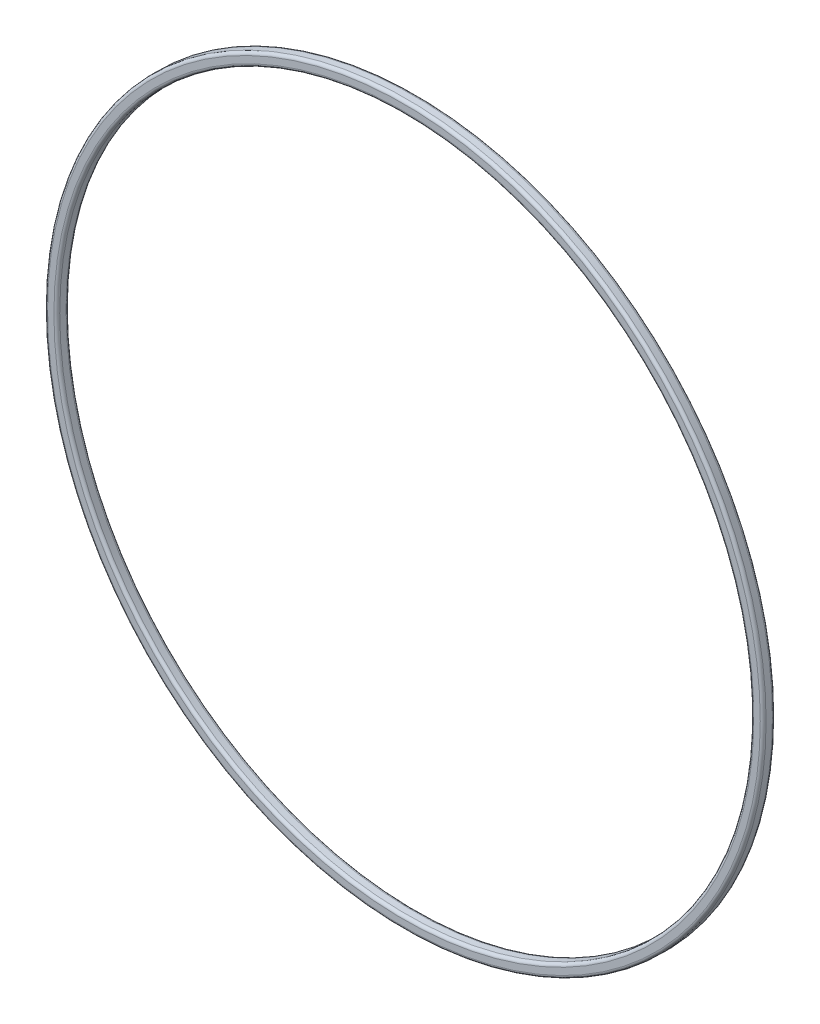
ISO-10303-21;
HEADER;
FILE_DESCRIPTION(('STEP AP214'),'2;1');
FILE_NAME('part.step','',(''),(''),'','','');
FILE_SCHEMA(('AUTOMOTIVE_DESIGN { 1 0 10303 214 1 1 1 1 }'));
ENDSEC;
DATA;
#1=APPLICATION_CONTEXT('core data for automotive mechanical design processes');
#2=APPLICATION_PROTOCOL_DEFINITION('international standard','automotive_design',2000,#1);
#3=PRODUCT_CONTEXT('',#1,'mechanical');
#4=PRODUCT('Part','Part','',(#3));
#5=PRODUCT_RELATED_PRODUCT_CATEGORY('part','',(#4));
#6=PRODUCT_DEFINITION_FORMATION('','',#4);
#7=PRODUCT_DEFINITION_CONTEXT('part definition',#1,'design');
#8=PRODUCT_DEFINITION('design','',#6,#7);
#9=PRODUCT_DEFINITION_SHAPE('','',#8);
#10=(LENGTH_UNIT() NAMED_UNIT(*) SI_UNIT(.MILLI.,.METRE.));
#11=(NAMED_UNIT(*) PLANE_ANGLE_UNIT() SI_UNIT($,.RADIAN.));
#12=(NAMED_UNIT(*) SI_UNIT($,.STERADIAN.) SOLID_ANGLE_UNIT());
#13=UNCERTAINTY_MEASURE_WITH_UNIT(LENGTH_MEASURE(1.E-05),#10,'distance_accuracy_value','');
#14=(GEOMETRIC_REPRESENTATION_CONTEXT(3) GLOBAL_UNCERTAINTY_ASSIGNED_CONTEXT((#13)) GLOBAL_UNIT_ASSIGNED_CONTEXT((#10,
#11,#12)) REPRESENTATION_CONTEXT('',''));
#15=CARTESIAN_POINT('',(0.,0.,0.));
#16=DIRECTION('',(0.,0.,1.));
#17=DIRECTION('',(1.,0.,0.));
#18=AXIS2_PLACEMENT_3D('',#15,#16,#17);
#19=CARTESIAN_POINT('',(0.,0.,0.82550000000001));
#20=DIRECTION('',(0.,0.,-1.));
#21=DIRECTION('',(-1.,0.,0.));
#22=AXIS2_PLACEMENT_3D('',#19,#20,#21);
#23=TOROIDAL_SURFACE('',#22,92.9005,0.761999999999999);
#24=CARTESIAN_POINT('',(0.,0.,1.58750000000001));
#25=DIRECTION('',(0.,0.,-1.));
#26=DIRECTION('',(-1.,0.,0.));
#27=AXIS2_PLACEMENT_3D('',#24,#25,#26);
#28=CIRCLE('',#27,92.9005);
#29=CARTESIAN_POINT('',(-92.9005,0.,1.58750000000001));
#30=VERTEX_POINT('',#29);
#31=EDGE_CURVE('E10',#30,#30,#28,.T.);
#32=ORIENTED_EDGE('',*,*,#31,.T.);
#33=EDGE_LOOP('',(#32));
#34=FACE_BOUND('',#33,.T.);
#35=CARTESIAN_POINT('',(0.,0.,0.82550000000001));
#36=DIRECTION('',(0.,0.,-1.));
#37=DIRECTION('',(-1.,0.,0.));
#38=AXIS2_PLACEMENT_3D('',#35,#36,#37);
#39=CIRCLE('',#38,93.6625);
#40=CARTESIAN_POINT('',(-93.6625,0.,0.82550000000001));
#41=VERTEX_POINT('',#40);
#42=EDGE_CURVE('E60',#41,#41,#39,.T.);
#43=ORIENTED_EDGE('',*,*,#42,.F.);
#44=EDGE_LOOP('',(#43));
#45=FACE_BOUND('',#44,.T.);
#46=ADVANCED_FACE('F32',(#34,#45),#23,.T.);
#47=CARTESIAN_POINT('',(0.,92.9005,1.58750000000001));
#48=DIRECTION('',(0.,0.,1.));
#49=DIRECTION('',(1.,0.,0.));
#50=AXIS2_PLACEMENT_3D('',#47,#48,#49);
#51=PLANE('',#50);
#52=CARTESIAN_POINT('',(0.,0.,1.58750000000001));
#53=DIRECTION('',(0.,0.,-1.));
#54=DIRECTION('',(-1.,0.,0.));
#55=AXIS2_PLACEMENT_3D('',#52,#53,#54);
#56=CIRCLE('',#55,91.2495);
#57=CARTESIAN_POINT('',(-91.2495,0.,1.58750000000001));
#58=VERTEX_POINT('',#57);
#59=EDGE_CURVE('E38',#58,#58,#56,.T.);
#60=ORIENTED_EDGE('',*,*,#59,.T.);
#61=EDGE_LOOP('',(#60));
#62=FACE_BOUND('',#61,.T.);
#63=ORIENTED_EDGE('',*,*,#31,.F.);
#64=EDGE_LOOP('',(#63));
#65=FACE_BOUND('',#64,.T.);
#66=ADVANCED_FACE('F68',(#62,#65),#51,.T.);
#67=CARTESIAN_POINT('',(0.,0.,0.82550000000001));
#68=DIRECTION('',(0.,0.,-1.));
#69=DIRECTION('',(-1.,0.,0.));
#70=AXIS2_PLACEMENT_3D('',#67,#68,#69);
#71=TOROIDAL_SURFACE('',#70,91.2495,0.761999999999999);
#72=CARTESIAN_POINT('',(0.,0.,0.82550000000001));
#73=DIRECTION('',(0.,0.,-1.));
#74=DIRECTION('',(-1.,0.,0.));
#75=AXIS2_PLACEMENT_3D('',#72,#73,#74);
#76=CIRCLE('',#75,90.4875);
#77=CARTESIAN_POINT('',(-90.4875,0.,0.82550000000001));
#78=VERTEX_POINT('',#77);
#79=EDGE_CURVE('E42',#78,#78,#76,.T.);
#80=ORIENTED_EDGE('',*,*,#79,.T.);
#81=EDGE_LOOP('',(#80));
#82=FACE_BOUND('',#81,.T.);
#83=ORIENTED_EDGE('',*,*,#59,.F.);
#84=EDGE_LOOP('',(#83));
#85=FACE_BOUND('',#84,.T.);
#86=ADVANCED_FACE('F72',(#82,#85),#71,.T.);
#87=CARTESIAN_POINT('',(0.,0.,0.));
#88=DIRECTION('',(0.,0.,-1.));
#89=DIRECTION('',(-1.,0.,0.));
#90=AXIS2_PLACEMENT_3D('',#87,#88,#89);
#91=CYLINDRICAL_SURFACE('',#90,90.4875);
#92=CARTESIAN_POINT('',(0.,0.,-0.825500000000007));
#93=DIRECTION('',(0.,0.,-1.));
#94=DIRECTION('',(-1.,0.,0.));
#95=AXIS2_PLACEMENT_3D('',#92,#93,#94);
#96=CIRCLE('',#95,90.4875);
#97=CARTESIAN_POINT('',(-90.4875,0.,-0.825500000000007));
#98=VERTEX_POINT('',#97);
#99=EDGE_CURVE('E46',#98,#98,#96,.T.);
#100=ORIENTED_EDGE('',*,*,#99,.T.);
#101=EDGE_LOOP('',(#100));
#102=FACE_BOUND('',#101,.T.);
#103=ORIENTED_EDGE('',*,*,#79,.F.);
#104=EDGE_LOOP('',(#103));
#105=FACE_BOUND('',#104,.T.);
#106=ADVANCED_FACE('F76',(#102,#105),#91,.F.);
#107=CARTESIAN_POINT('',(0.,0.,-0.825500000000007));
#108=DIRECTION('',(0.,0.,-1.));
#109=DIRECTION('',(-1.,0.,0.));
#110=AXIS2_PLACEMENT_3D('',#107,#108,#109);
#111=TOROIDAL_SURFACE('',#110,91.2495,0.761999999999999);
#112=CARTESIAN_POINT('',(0.,0.,-1.58750000000001));
#113=DIRECTION('',(0.,0.,-1.));
#114=DIRECTION('',(-1.,0.,0.));
#115=AXIS2_PLACEMENT_3D('',#112,#113,#114);
#116=CIRCLE('',#115,91.2495);
#117=CARTESIAN_POINT('',(-91.2495,0.,-1.58750000000001));
#118=VERTEX_POINT('',#117);
#119=EDGE_CURVE('E51',#118,#118,#116,.T.);
#120=ORIENTED_EDGE('',*,*,#119,.T.);
#121=EDGE_LOOP('',(#120));
#122=FACE_BOUND('',#121,.T.);
#123=ORIENTED_EDGE('',*,*,#99,.F.);
#124=EDGE_LOOP('',(#123));
#125=FACE_BOUND('',#124,.T.);
#126=ADVANCED_FACE('F83',(#122,#125),#111,.T.);
#127=CARTESIAN_POINT('',(0.,92.9005,-1.58750000000001));
#128=DIRECTION('',(0.,0.,-1.));
#129=DIRECTION('',(-1.,0.,0.));
#130=AXIS2_PLACEMENT_3D('',#127,#128,#129);
#131=PLANE('',#130);
#132=CARTESIAN_POINT('',(0.,0.,-1.58750000000001));
#133=DIRECTION('',(0.,0.,-1.));
#134=DIRECTION('',(-1.,0.,0.));
#135=AXIS2_PLACEMENT_3D('',#132,#133,#134);
#136=CIRCLE('',#135,92.9005);
#137=CARTESIAN_POINT('',(-92.9005,0.,-1.58750000000001));
#138=VERTEX_POINT('',#137);
#139=EDGE_CURVE('E54',#138,#138,#136,.T.);
#140=ORIENTED_EDGE('',*,*,#139,.T.);
#141=EDGE_LOOP('',(#140));
#142=FACE_BOUND('',#141,.T.);
#143=ORIENTED_EDGE('',*,*,#119,.F.);
#144=EDGE_LOOP('',(#143));
#145=FACE_BOUND('',#144,.T.);
#146=ADVANCED_FACE('F87',(#142,#145),#131,.T.);
#147=CARTESIAN_POINT('',(0.,0.,-0.825500000000007));
#148=DIRECTION('',(0.,0.,-1.));
#149=DIRECTION('',(-1.,0.,0.));
#150=AXIS2_PLACEMENT_3D('',#147,#148,#149);
#151=TOROIDAL_SURFACE('',#150,92.9005,0.761999999999999);
#152=CARTESIAN_POINT('',(0.,0.,-0.825500000000006));
#153=DIRECTION('',(0.,0.,-1.));
#154=DIRECTION('',(-1.,0.,0.));
#155=AXIS2_PLACEMENT_3D('',#152,#153,#154);
#156=CIRCLE('',#155,93.6625);
#157=CARTESIAN_POINT('',(-93.6625,0.,-0.825500000000006));
#158=VERTEX_POINT('',#157);
#159=EDGE_CURVE('E57',#158,#158,#156,.T.);
#160=ORIENTED_EDGE('',*,*,#159,.T.);
#161=EDGE_LOOP('',(#160));
#162=FACE_BOUND('',#161,.T.);
#163=ORIENTED_EDGE('',*,*,#139,.F.);
#164=EDGE_LOOP('',(#163));
#165=FACE_BOUND('',#164,.T.);
#166=ADVANCED_FACE('F91',(#162,#165),#151,.T.);
#167=CARTESIAN_POINT('',(0.,0.,0.));
#168=DIRECTION('',(0.,0.,-1.));
#169=DIRECTION('',(-1.,0.,0.));
#170=AXIS2_PLACEMENT_3D('',#167,#168,#169);
#171=CYLINDRICAL_SURFACE('',#170,93.6625);
#172=ORIENTED_EDGE('',*,*,#42,.T.);
#173=EDGE_LOOP('',(#172));
#174=FACE_BOUND('',#173,.T.);
#175=ORIENTED_EDGE('',*,*,#159,.F.);
#176=EDGE_LOOP('',(#175));
#177=FACE_BOUND('',#176,.T.);
#178=ADVANCED_FACE('F64',(#174,#177),#171,.T.);
#179=CLOSED_SHELL('',(#46,#66,#86,#106,#126,#146,#166,#178));
#180=MANIFOLD_SOLID_BREP('B2',#179);
#181=ADVANCED_BREP_SHAPE_REPRESENTATION('',(#18,#180),#14);
#182=SHAPE_DEFINITION_REPRESENTATION(#9,#181);
ENDSEC;
END-ISO-10303-21;
